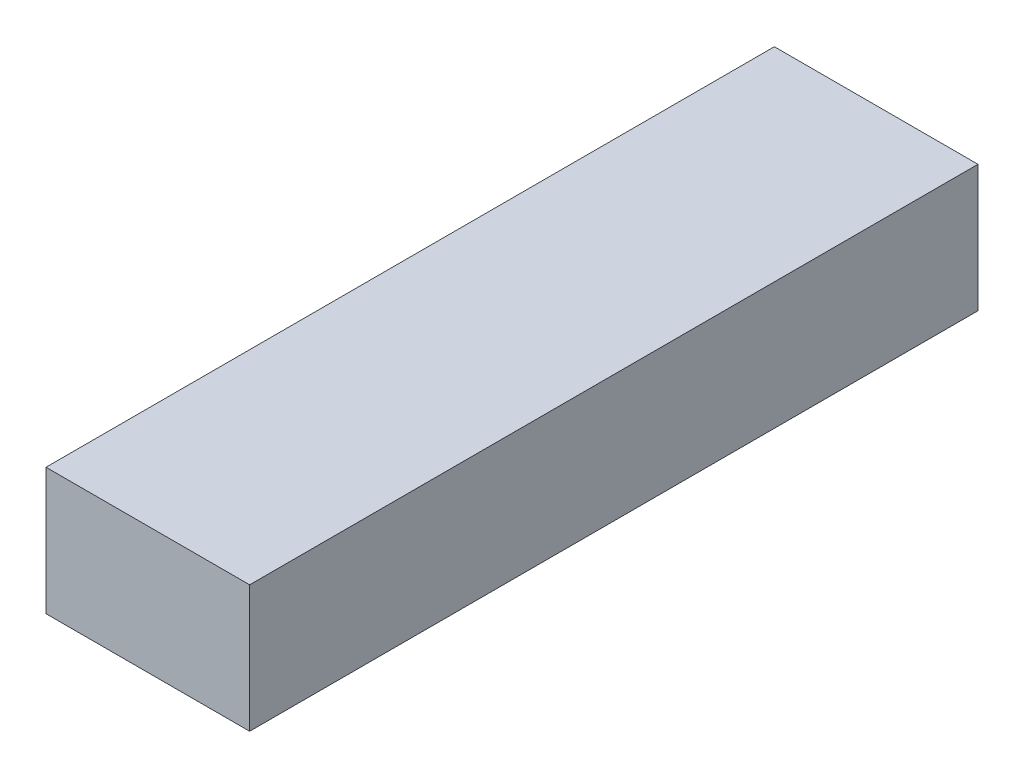
ISO-10303-21;
HEADER;
FILE_DESCRIPTION(('STEP AP214'),'2;1');
FILE_NAME('part.step','',(''),(''),'','','');
FILE_SCHEMA(('AUTOMOTIVE_DESIGN { 1 0 10303 214 1 1 1 1 }'));
ENDSEC;
DATA;
#1=APPLICATION_CONTEXT('core data for automotive mechanical design processes');
#2=APPLICATION_PROTOCOL_DEFINITION('international standard','automotive_design',2000,#1);
#3=PRODUCT_CONTEXT('',#1,'mechanical');
#4=PRODUCT('Part','Part','',(#3));
#5=PRODUCT_RELATED_PRODUCT_CATEGORY('part','',(#4));
#6=PRODUCT_DEFINITION_FORMATION('','',#4);
#7=PRODUCT_DEFINITION_CONTEXT('part definition',#1,'design');
#8=PRODUCT_DEFINITION('design','',#6,#7);
#9=PRODUCT_DEFINITION_SHAPE('','',#8);
#10=(LENGTH_UNIT() NAMED_UNIT(*) SI_UNIT(.MILLI.,.METRE.));
#11=(NAMED_UNIT(*) PLANE_ANGLE_UNIT() SI_UNIT($,.RADIAN.));
#12=(NAMED_UNIT(*) SI_UNIT($,.STERADIAN.) SOLID_ANGLE_UNIT());
#13=UNCERTAINTY_MEASURE_WITH_UNIT(LENGTH_MEASURE(1.E-05),#10,'distance_accuracy_value','');
#14=(GEOMETRIC_REPRESENTATION_CONTEXT(3) GLOBAL_UNCERTAINTY_ASSIGNED_CONTEXT((#13)) GLOBAL_UNIT_ASSIGNED_CONTEXT((#10,
#11,#12)) REPRESENTATION_CONTEXT('',''));
#15=CARTESIAN_POINT('',(0.,0.,0.));
#16=DIRECTION('',(0.,0.,1.));
#17=DIRECTION('',(1.,0.,0.));
#18=AXIS2_PLACEMENT_3D('',#15,#16,#17);
#19=CARTESIAN_POINT('',(-9.80419301977679,-67.649975,120.));
#20=DIRECTION('',(-1.,0.,0.));
#21=DIRECTION('',(0.,-1.,0.));
#22=AXIS2_PLACEMENT_3D('',#19,#20,#21);
#23=PLANE('',#22);
#24=DIRECTION('',(0.,1.,0.));
#25=VECTOR('',#24,1.);
#26=CARTESIAN_POINT('',(-9.80419301977679,-67.649975,0.));
#27=LINE('',#26,#25);
#28=CARTESIAN_POINT('',(-9.80419301977679,-67.649975,0.));
#29=VERTEX_POINT('',#28);
#30=CARTESIAN_POINT('',(-9.80419301977679,-46.7499750000001,0.));
#31=VERTEX_POINT('',#30);
#32=EDGE_CURVE('E95',#29,#31,#27,.T.);
#33=ORIENTED_EDGE('',*,*,#32,.T.);
#34=DIRECTION('',(0.,0.,-1.));
#35=VECTOR('',#34,1.);
#36=CARTESIAN_POINT('',(-9.80419301977679,-46.7499750000001,120.));
#37=LINE('',#36,#35);
#38=CARTESIAN_POINT('',(-9.80419301977679,-46.7499750000001,120.));
#39=VERTEX_POINT('',#38);
#40=EDGE_CURVE('E11',#39,#31,#37,.T.);
#41=ORIENTED_EDGE('',*,*,#40,.F.);
#42=DIRECTION('',(0.,1.,0.));
#43=VECTOR('',#42,1.);
#44=CARTESIAN_POINT('',(-9.80419301977679,-67.649975,120.));
#45=LINE('',#44,#43);
#46=CARTESIAN_POINT('',(-9.80419301977679,-67.649975,120.));
#47=VERTEX_POINT('',#46);
#48=EDGE_CURVE('E83',#47,#39,#45,.T.);
#49=ORIENTED_EDGE('',*,*,#48,.F.);
#50=DIRECTION('',(0.,0.,-1.));
#51=VECTOR('',#50,1.);
#52=CARTESIAN_POINT('',(-9.80419301977679,-67.649975,120.));
#53=LINE('',#52,#51);
#54=EDGE_CURVE('E91',#47,#29,#53,.T.);
#55=ORIENTED_EDGE('',*,*,#54,.T.);
#56=EDGE_LOOP('',(#33,#41,#49,#55));
#57=FACE_BOUND('',#56,.T.);
#58=ADVANCED_FACE('F32',(#57),#23,.F.);
#59=CARTESIAN_POINT('',(-43.3541930197768,-46.7499750000001,120.));
#60=DIRECTION('',(0.,-1.,0.));
#61=DIRECTION('',(0.,0.,-1.));
#62=AXIS2_PLACEMENT_3D('',#59,#60,#61);
#63=PLANE('',#62);
#64=DIRECTION('',(-1.,0.,0.));
#65=VECTOR('',#64,1.);
#66=CARTESIAN_POINT('',(-43.3541930197768,-46.7499750000001,0.));
#67=LINE('',#66,#65);
#68=CARTESIAN_POINT('',(-43.3541930197768,-46.7499750000001,0.));
#69=VERTEX_POINT('',#68);
#70=EDGE_CURVE('E87',#31,#69,#67,.T.);
#71=ORIENTED_EDGE('',*,*,#70,.T.);
#72=DIRECTION('',(0.,0.,-1.));
#73=VECTOR('',#72,1.);
#74=CARTESIAN_POINT('',(-43.3541930197768,-46.7499750000001,120.));
#75=LINE('',#74,#73);
#76=CARTESIAN_POINT('',(-43.3541930197768,-46.7499750000001,120.));
#77=VERTEX_POINT('',#76);
#78=EDGE_CURVE('E40',#77,#69,#75,.T.);
#79=ORIENTED_EDGE('',*,*,#78,.F.);
#80=DIRECTION('',(-1.,0.,0.));
#81=VECTOR('',#80,1.);
#82=CARTESIAN_POINT('',(-43.3541930197768,-46.7499750000001,120.));
#83=LINE('',#82,#81);
#84=EDGE_CURVE('E78',#39,#77,#83,.T.);
#85=ORIENTED_EDGE('',*,*,#84,.F.);
#86=ORIENTED_EDGE('',*,*,#40,.T.);
#87=EDGE_LOOP('',(#71,#79,#85,#86));
#88=FACE_BOUND('',#87,.T.);
#89=ADVANCED_FACE('F86',(#88),#63,.F.);
#90=CARTESIAN_POINT('',(-43.3541930197768,-67.649975,120.));
#91=DIRECTION('',(1.,0.,0.));
#92=DIRECTION('',(0.,0.,-1.));
#93=AXIS2_PLACEMENT_3D('',#90,#91,#92);
#94=PLANE('',#93);
#95=DIRECTION('',(0.,-1.,0.));
#96=VECTOR('',#95,1.);
#97=CARTESIAN_POINT('',(-43.3541930197768,-67.649975,0.));
#98=LINE('',#97,#96);
#99=CARTESIAN_POINT('',(-43.3541930197768,-67.649975,0.));
#100=VERTEX_POINT('',#99);
#101=EDGE_CURVE('E65',#69,#100,#98,.T.);
#102=ORIENTED_EDGE('',*,*,#101,.T.);
#103=DIRECTION('',(0.,0.,-1.));
#104=VECTOR('',#103,1.);
#105=CARTESIAN_POINT('',(-43.3541930197768,-67.649975,120.));
#106=LINE('',#105,#104);
#107=CARTESIAN_POINT('',(-43.3541930197768,-67.649975,120.));
#108=VERTEX_POINT('',#107);
#109=EDGE_CURVE('E88',#108,#100,#106,.T.);
#110=ORIENTED_EDGE('',*,*,#109,.F.);
#111=DIRECTION('',(0.,-1.,0.));
#112=VECTOR('',#111,1.);
#113=CARTESIAN_POINT('',(-43.3541930197768,-67.649975,120.));
#114=LINE('',#113,#112);
#115=EDGE_CURVE('E81',#77,#108,#114,.T.);
#116=ORIENTED_EDGE('',*,*,#115,.F.);
#117=ORIENTED_EDGE('',*,*,#78,.T.);
#118=EDGE_LOOP('',(#102,#110,#116,#117));
#119=FACE_BOUND('',#118,.T.);
#120=ADVANCED_FACE('F89',(#119),#94,.F.);
#121=CARTESIAN_POINT('',(-43.3541930197768,-67.649975,120.));
#122=DIRECTION('',(0.,1.,0.));
#123=DIRECTION('',(0.,0.,1.));
#124=AXIS2_PLACEMENT_3D('',#121,#122,#123);
#125=PLANE('',#124);
#126=DIRECTION('',(1.,0.,0.));
#127=VECTOR('',#126,1.);
#128=CARTESIAN_POINT('',(-43.3541930197768,-67.649975,0.));
#129=LINE('',#128,#127);
#130=EDGE_CURVE('E71',#100,#29,#129,.T.);
#131=ORIENTED_EDGE('',*,*,#130,.T.);
#132=ORIENTED_EDGE('',*,*,#54,.F.);
#133=DIRECTION('',(1.,0.,0.));
#134=VECTOR('',#133,1.);
#135=CARTESIAN_POINT('',(-43.3541930197768,-67.649975,120.));
#136=LINE('',#135,#134);
#137=EDGE_CURVE('E48',#108,#47,#136,.T.);
#138=ORIENTED_EDGE('',*,*,#137,.F.);
#139=ORIENTED_EDGE('',*,*,#109,.T.);
#140=EDGE_LOOP('',(#131,#132,#138,#139));
#141=FACE_BOUND('',#140,.T.);
#142=ADVANCED_FACE('F102',(#141),#125,.F.);
#143=CARTESIAN_POINT('',(0.,0.,120.));
#144=DIRECTION('',(0.,0.,-1.));
#145=DIRECTION('',(-1.,0.,0.));
#146=AXIS2_PLACEMENT_3D('',#143,#144,#145);
#147=PLANE('',#146);
#148=ORIENTED_EDGE('',*,*,#48,.T.);
#149=ORIENTED_EDGE('',*,*,#84,.T.);
#150=ORIENTED_EDGE('',*,*,#115,.T.);
#151=ORIENTED_EDGE('',*,*,#137,.T.);
#152=EDGE_LOOP('',(#148,#149,#150,#151));
#153=FACE_BOUND('',#152,.T.);
#154=ADVANCED_FACE('F79',(#153),#147,.F.);
#155=CARTESIAN_POINT('',(0.,0.,0.));
#156=DIRECTION('',(0.,0.,-1.));
#157=DIRECTION('',(-1.,0.,0.));
#158=AXIS2_PLACEMENT_3D('',#155,#156,#157);
#159=PLANE('',#158);
#160=ORIENTED_EDGE('',*,*,#32,.F.);
#161=ORIENTED_EDGE('',*,*,#130,.F.);
#162=ORIENTED_EDGE('',*,*,#101,.F.);
#163=ORIENTED_EDGE('',*,*,#70,.F.);
#164=EDGE_LOOP('',(#160,#161,#162,#163));
#165=FACE_BOUND('',#164,.T.);
#166=ADVANCED_FACE('F105',(#165),#159,.T.);
#167=CLOSED_SHELL('',(#58,#89,#120,#142,#154,#166));
#168=MANIFOLD_SOLID_BREP('B2',#167);
#169=ADVANCED_BREP_SHAPE_REPRESENTATION('',(#18,#168),#14);
#170=SHAPE_DEFINITION_REPRESENTATION(#9,#169);
ENDSEC;
END-ISO-10303-21;
